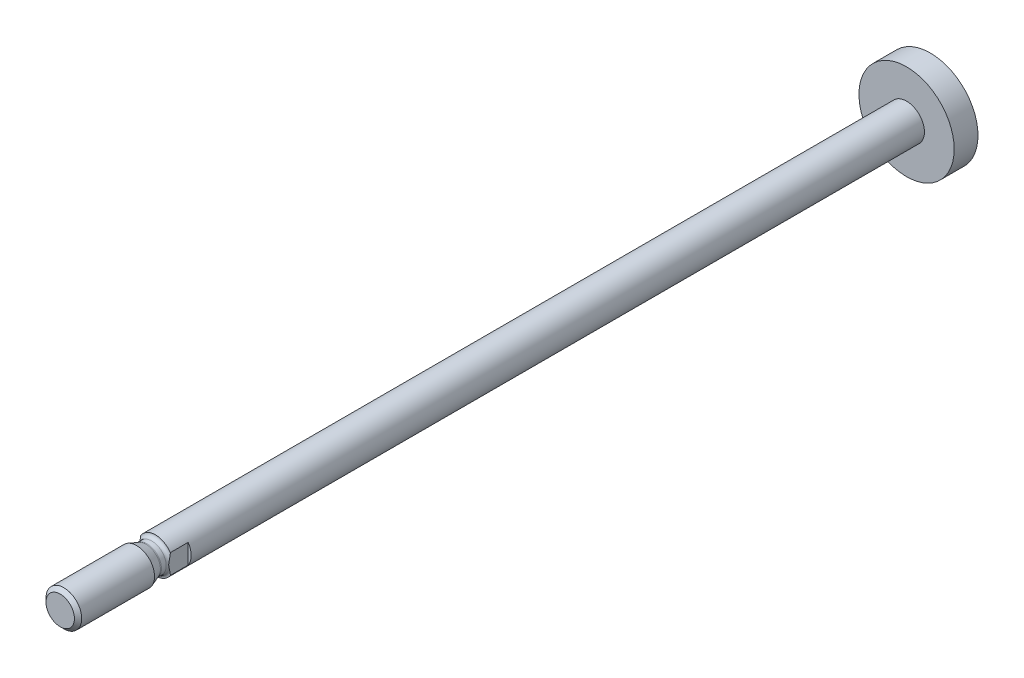
ISO-10303-21;
HEADER;
FILE_DESCRIPTION(('STEP AP214'),'2;1');
FILE_NAME('part.step','',(''),(''),'','','');
FILE_SCHEMA(('AUTOMOTIVE_DESIGN { 1 0 10303 214 1 1 1 1 }'));
ENDSEC;
DATA;
#1=APPLICATION_CONTEXT('core data for automotive mechanical design processes');
#2=APPLICATION_PROTOCOL_DEFINITION('international standard','automotive_design',2000,#1);
#3=PRODUCT_CONTEXT('',#1,'mechanical');
#4=PRODUCT('Part','Part','',(#3));
#5=PRODUCT_RELATED_PRODUCT_CATEGORY('part','',(#4));
#6=PRODUCT_DEFINITION_FORMATION('','',#4);
#7=PRODUCT_DEFINITION_CONTEXT('part definition',#1,'design');
#8=PRODUCT_DEFINITION('design','',#6,#7);
#9=PRODUCT_DEFINITION_SHAPE('','',#8);
#10=(LENGTH_UNIT() NAMED_UNIT(*) SI_UNIT(.MILLI.,.METRE.));
#11=(NAMED_UNIT(*) PLANE_ANGLE_UNIT() SI_UNIT($,.RADIAN.));
#12=(NAMED_UNIT(*) SI_UNIT($,.STERADIAN.) SOLID_ANGLE_UNIT());
#13=UNCERTAINTY_MEASURE_WITH_UNIT(LENGTH_MEASURE(1.E-05),#10,'distance_accuracy_value','');
#14=(GEOMETRIC_REPRESENTATION_CONTEXT(3) GLOBAL_UNCERTAINTY_ASSIGNED_CONTEXT((#13)) GLOBAL_UNIT_ASSIGNED_CONTEXT((#10,
#11,#12)) REPRESENTATION_CONTEXT('',''));
#15=CARTESIAN_POINT('',(0.,0.,0.));
#16=DIRECTION('',(0.,0.,1.));
#17=DIRECTION('',(1.,0.,0.));
#18=AXIS2_PLACEMENT_3D('',#15,#16,#17);
#19=CARTESIAN_POINT('',(0.,0.,-125.2));
#20=DIRECTION('',(0.,0.,1.));
#21=DIRECTION('',(1.,0.,0.));
#22=AXIS2_PLACEMENT_3D('',#19,#20,#21);
#23=CYLINDRICAL_SURFACE('',#22,3.);
#24=CARTESIAN_POINT('',(0.,0.,-121.2));
#25=DIRECTION('',(0.,0.,1.));
#26=DIRECTION('',(1.,0.,0.));
#27=AXIS2_PLACEMENT_3D('',#24,#25,#26);
#28=CIRCLE('',#27,3.);
#29=CARTESIAN_POINT('',(3.,0.,-121.2));
#30=VERTEX_POINT('',#29);
#31=EDGE_CURVE('E125',#30,#30,#28,.T.);
#32=ORIENTED_EDGE('',*,*,#31,.T.);
#33=EDGE_LOOP('',(#32));
#34=FACE_BOUND('',#33,.T.);
#35=DIRECTION('',(0.,0.,1.));
#36=VECTOR('',#35,1.);
#37=CARTESIAN_POINT('',(-2.5,-1.6583123951777,-125.2));
#38=LINE('',#37,#36);
#39=CARTESIAN_POINT('',(-2.5,-1.6583123951777,2.));
#40=VERTEX_POINT('',#39);
#41=CARTESIAN_POINT('',(-2.5,-1.6583123951777,5.));
#42=VERTEX_POINT('',#41);
#43=EDGE_CURVE('E55',#40,#42,#38,.T.);
#44=ORIENTED_EDGE('',*,*,#43,.F.);
#45=CARTESIAN_POINT('',(0.,0.,2.));
#46=DIRECTION('',(0.,0.,1.));
#47=DIRECTION('',(1.,0.,0.));
#48=AXIS2_PLACEMENT_3D('',#45,#46,#47);
#49=CIRCLE('',#48,3.);
#50=CARTESIAN_POINT('',(-2.5,1.6583123951777,2.));
#51=VERTEX_POINT('',#50);
#52=EDGE_CURVE('E11',#51,#40,#49,.T.);
#53=ORIENTED_EDGE('',*,*,#52,.F.);
#54=DIRECTION('',(0.,0.,1.));
#55=VECTOR('',#54,1.);
#56=CARTESIAN_POINT('',(-2.5,1.6583123951777,-125.2));
#57=LINE('',#56,#55);
#58=CARTESIAN_POINT('',(-2.5,1.65831239517778,4.99999999999909));
#59=VERTEX_POINT('',#58);
#60=EDGE_CURVE('E95',#59,#51,#57,.F.);
#61=ORIENTED_EDGE('',*,*,#60,.F.);
#62=CARTESIAN_POINT('',(0.,0.,5.));
#63=DIRECTION('',(0.,0.,1.));
#64=DIRECTION('',(1.,0.,0.));
#65=AXIS2_PLACEMENT_3D('',#62,#63,#64);
#66=CIRCLE('',#65,3.);
#67=CARTESIAN_POINT('',(2.5,1.6583123951777,5.));
#68=VERTEX_POINT('',#67);
#69=EDGE_CURVE('E94',#68,#59,#66,.T.);
#70=ORIENTED_EDGE('',*,*,#69,.F.);
#71=DIRECTION('',(0.,0.,1.));
#72=VECTOR('',#71,1.);
#73=CARTESIAN_POINT('',(2.5,1.6583123951777,-125.2));
#74=LINE('',#73,#72);
#75=CARTESIAN_POINT('',(2.5,1.6583123951777,2.));
#76=VERTEX_POINT('',#75);
#77=EDGE_CURVE('E63',#76,#68,#74,.T.);
#78=ORIENTED_EDGE('',*,*,#77,.F.);
#79=CARTESIAN_POINT('',(2.5,-1.6583123951777,2.));
#80=VERTEX_POINT('',#79);
#81=EDGE_CURVE('E44',#80,#76,#49,.T.);
#82=ORIENTED_EDGE('',*,*,#81,.F.);
#83=DIRECTION('',(0.,0.,1.));
#84=VECTOR('',#83,1.);
#85=CARTESIAN_POINT('',(2.5,-1.6583123951777,-125.2));
#86=LINE('',#85,#84);
#87=CARTESIAN_POINT('',(2.5,-1.65831239517778,4.99999999999909));
#88=VERTEX_POINT('',#87);
#89=EDGE_CURVE('E88',#88,#80,#86,.F.);
#90=ORIENTED_EDGE('',*,*,#89,.F.);
#91=EDGE_CURVE('E128',#42,#88,#66,.T.);
#92=ORIENTED_EDGE('',*,*,#91,.F.);
#93=EDGE_LOOP('',(#44,#53,#61,#70,#78,#82,#90,#92));
#94=FACE_BOUND('',#93,.T.);
#95=ADVANCED_FACE('F41',(#34,#94),#23,.T.);
#96=CARTESIAN_POINT('',(0.,0.,5.6000000000001));
#97=DIRECTION('',(0.,0.,1.));
#98=DIRECTION('',(1.,0.,0.));
#99=AXIS2_PLACEMENT_3D('',#96,#97,#98);
#100=TOROIDAL_SURFACE('',#99,3.0000000000001,0.600000000000099);
#101=CARTESIAN_POINT('',(0.,0.,5.6));
#102=DIRECTION('',(0.,0.,1.));
#103=DIRECTION('',(1.,0.,0.));
#104=AXIS2_PLACEMENT_3D('',#101,#102,#103);
#105=CIRCLE('',#104,2.4);
#106=CARTESIAN_POINT('',(2.4,0.,5.6));
#107=VERTEX_POINT('',#106);
#108=EDGE_CURVE('E116',#107,#107,#105,.T.);
#109=ORIENTED_EDGE('',*,*,#108,.F.);
#110=EDGE_LOOP('',(#109));
#111=FACE_BOUND('',#110,.T.);
#112=CARTESIAN_POINT('',(-2.5,0.,5.26833752096453));
#113=CARTESIAN_POINT('',(-2.5,0.0507234426297441,5.26834839993848));
#114=CARTESIAN_POINT('',(-2.5,0.101441776799662,5.26596843791489));
#115=CARTESIAN_POINT('',(-2.5,0.202536067556288,5.2569952015163));
#116=CARTESIAN_POINT('',(-2.5,0.252911588949165,5.2503973212644));
#117=CARTESIAN_POINT('',(-2.5,0.35392632203634,5.23403658213965));
#118=CARTESIAN_POINT('',(-2.5,0.404557369480025,5.224225913585));
#119=CARTESIAN_POINT('',(-2.5,0.505400398866161,5.20278595137819));
#120=CARTESIAN_POINT('',(-2.5,0.555612509775304,5.1911572409283));
#121=CARTESIAN_POINT('',(-2.5,0.655655613826413,5.16721678219831));
#122=CARTESIAN_POINT('',(-2.5,0.705487327239528,5.15490798008948));
#123=CARTESIAN_POINT('',(-2.5,0.805181864056362,5.13041893752706));
#124=CARTESIAN_POINT('',(-2.5,0.855044688832192,5.11823870324147));
#125=CARTESIAN_POINT('',(-2.5,1.00507376125951,5.08293674920261));
#126=CARTESIAN_POINT('',(-2.5,1.1055660279648,5.06108488117838));
#127=CARTESIAN_POINT('',(-2.5,1.30645493621981,5.02592717471424));
#128=CARTESIAN_POINT('',(-2.5,1.40682678389803,5.01248870030289));
#129=CARTESIAN_POINT('',(-2.5,1.60840199518987,4.99838763017595));
#130=CARTESIAN_POINT('',(-2.5,1.70960094347028,4.99767823287719));
#131=CARTESIAN_POINT('',(-2.5,1.86622781794818,5.01106448653587));
#132=CARTESIAN_POINT('',(-2.5,1.92218137883188,5.01877622049858));
#133=CARTESIAN_POINT('',(-2.5,2.03285053262341,5.0413651074687));
#134=CARTESIAN_POINT('',(-2.5,2.08756307823151,5.05625824117348));
#135=CARTESIAN_POINT('',(-2.5,2.18328084843635,5.09083457513036));
#136=CARTESIAN_POINT('',(-2.5,2.22483950461237,5.10896465354793));
#137=CARTESIAN_POINT('',(-2.5,2.30459524648064,5.1515245306446));
#138=CARTESIAN_POINT('',(-2.5,2.34279989724468,5.17593963670877));
#139=CARTESIAN_POINT('',(-2.5,2.40362753966407,5.22361594487622));
#140=CARTESIAN_POINT('',(-2.5,2.42757076392253,5.24518752529637));
#141=CARTESIAN_POINT('',(-2.5,2.47175757689057,5.29185573262645));
#142=CARTESIAN_POINT('',(-2.5,2.49200531158724,5.31694835263777));
#143=CARTESIAN_POINT('',(-2.5,2.52468492158815,5.36594738678137));
#144=CARTESIAN_POINT('',(-2.5,2.53785643218482,5.38935828111803));
#145=CARTESIAN_POINT('',(-2.5,2.56013164913301,5.43805384411947));
#146=CARTESIAN_POINT('',(-2.5,2.56923737677398,5.46333757440499));
#147=CARTESIAN_POINT('',(-2.5,2.58283057049981,5.51527496834575));
#148=CARTESIAN_POINT('',(-2.5,2.58729356105886,5.54193512227162));
#149=CARTESIAN_POINT('',(-2.5,2.59118020467599,5.59561989324821));
#150=CARTESIAN_POINT('',(-2.5,2.5906054179438,5.62264439487102));
#151=CARTESIAN_POINT('',(-2.5,2.5847447911938,5.67371298536964));
#152=CARTESIAN_POINT('',(-2.5,2.57988467167735,5.69780754958458));
#153=CARTESIAN_POINT('',(-2.5,2.56633022368149,5.74488485425705));
#154=CARTESIAN_POINT('',(-2.5,2.55763543991684,5.76786746233366));
#155=CARTESIAN_POINT('',(-2.5,2.53647695281551,5.81308697753744));
#156=CARTESIAN_POINT('',(-2.5,2.52388217742275,5.83526203314746));
#157=CARTESIAN_POINT('',(-2.5,2.49565831542702,5.87756858678122));
#158=CARTESIAN_POINT('',(-2.5,2.4800283022487,5.897699457906));
#159=CARTESIAN_POINT('',(-2.5,2.4381803160609,5.94494905141413));
#160=CARTESIAN_POINT('',(-2.5,2.41048793322772,5.97076525046522));
#161=CARTESIAN_POINT('',(-2.5,2.35128940318857,6.01762864695372));
#162=CARTESIAN_POINT('',(-2.5,2.31977194494069,6.03866114436212));
#163=CARTESIAN_POINT('',(-2.5,2.23952256294481,6.08463351159361));
#164=CARTESIAN_POINT('',(-2.5,2.18939204577726,6.10711912432076));
#165=CARTESIAN_POINT('',(-2.5,2.086424206848,6.14398267826286));
#166=CARTESIAN_POINT('',(-2.5,2.03358928965091,6.15836768991921));
#167=CARTESIAN_POINT('',(-2.5,1.93599580204544,6.17849484994285));
#168=CARTESIAN_POINT('',(-2.5,1.89144834077192,6.18531116329585));
#169=CARTESIAN_POINT('',(-2.5,1.80189908033616,6.19505697557448));
#170=CARTESIAN_POINT('',(-2.5,1.75689686177072,6.19798247787778));
#171=CARTESIAN_POINT('',(-2.5,1.66646832286127,6.20053377831371));
#172=CARTESIAN_POINT('',(-2.5,1.6210413945456,6.20013412759755));
#173=CARTESIAN_POINT('',(-2.5,1.53034280767568,6.19650595241103));
#174=CARTESIAN_POINT('',(-2.5,1.48507106445849,6.1932793543307));
#175=CARTESIAN_POINT('',(-2.5,1.33918047559004,6.17906735223514));
#176=CARTESIAN_POINT('',(-2.5,1.23902345631669,6.16342028964884));
#177=CARTESIAN_POINT('',(-2.5,1.03994836030368,6.12508984420092));
#178=CARTESIAN_POINT('',(-2.5,0.941034235224376,6.10238806221333));
#179=CARTESIAN_POINT('',(-2.5,0.793509038998567,6.06677672186832));
#180=CARTESIAN_POINT('',(-2.5,0.7446863854637,6.054702575567));
#181=CARTESIAN_POINT('',(-2.5,0.646996290398524,6.030738686552));
#182=CARTESIAN_POINT('',(-2.5,0.598128851070118,6.0188489352388));
#183=CARTESIAN_POINT('',(-2.5,0.500334281886721,5.99617397742217));
#184=CARTESIAN_POINT('',(-2.5,0.451408146263369,5.98538460255591));
#185=CARTESIAN_POINT('',(-2.5,0.353119090508098,5.96594052833405));
#186=CARTESIAN_POINT('',(-2.5,0.303756196305667,5.95728570312374));
#187=CARTESIAN_POINT('',(-2.5,0.204122497966492,5.94328110899502));
#188=CARTESIAN_POINT('',(-2.5,0.153847567097064,5.93795905985694));
#189=CARTESIAN_POINT('',(-2.5,0.0530351286873156,5.93177082830429));
#190=CARTESIAN_POINT('',(-2.5,0.0024977994589948,5.930901937583));
#191=CARTESIAN_POINT('',(-2.5,-0.0985305210715612,5.93381110626722));
#192=CARTESIAN_POINT('',(-2.5,-0.14902123482016,5.93759813511376));
#193=CARTESIAN_POINT('',(-2.5,-0.249573888409545,5.94904126176878));
#194=CARTESIAN_POINT('',(-2.5,-0.299635458091892,5.95670041313862));
#195=CARTESIAN_POINT('',(-2.5,-0.399725252919972,5.97472154484855));
#196=CARTESIAN_POINT('',(-2.5,-0.449748880216866,5.98510788708088));
#197=CARTESIAN_POINT('',(-2.5,-0.549453617514231,6.00732659888942));
#198=CARTESIAN_POINT('',(-2.5,-0.599134785603654,6.01915871651809));
#199=CARTESIAN_POINT('',(-2.5,-0.698392421521691,6.04328051823731));
#200=CARTESIAN_POINT('',(-2.5,-0.747968869022546,6.05557028383309));
#201=CARTESIAN_POINT('',(-2.5,-0.84720464589227,6.07981009984425));
#202=CARTESIAN_POINT('',(-2.5,-0.896863971124109,6.0917601667094));
#203=CARTESIAN_POINT('',(-2.5,-0.975241469303783,6.10978478042876));
#204=CARTESIAN_POINT('',(-2.5,-1.00388150216564,6.11619624816889));
#205=CARTESIAN_POINT('',(-2.5,-1.06125902675178,6.12857195456169));
#206=CARTESIAN_POINT('',(-2.5,-1.08999652018277,6.13453618533974));
#207=CARTESIAN_POINT('',(-2.5,-1.14748265723325,6.1458846074232));
#208=CARTESIAN_POINT('',(-2.5,-1.17623091126653,6.15127075206469));
#209=CARTESIAN_POINT('',(-2.5,-1.23384312688132,6.16137594760793));
#210=CARTESIAN_POINT('',(-2.5,-1.26270708577413,6.16609501391968));
#211=CARTESIAN_POINT('',(-2.5,-1.34949136584038,6.17908804539659));
#212=CARTESIAN_POINT('',(-2.5,-1.40759592627029,6.18619616796949));
#213=CARTESIAN_POINT('',(-2.5,-1.52420669712544,6.19636423685649));
#214=CARTESIAN_POINT('',(-2.5,-1.58271310503325,6.1994220245478));
#215=CARTESIAN_POINT('',(-2.5,-1.70911532678372,6.20051114496721));
#216=CARTESIAN_POINT('',(-2.5,-1.77702602049488,6.19766666103081));
#217=CARTESIAN_POINT('',(-2.5,-1.912149147007,6.18315262249392));
#218=CARTESIAN_POINT('',(-2.5,-1.97936016975703,6.17146782027944));
#219=CARTESIAN_POINT('',(-2.5,-2.09293467910467,6.14162835403314));
#220=CARTESIAN_POINT('',(-2.5,-2.1399801193776,6.12611102431254));
#221=CARTESIAN_POINT('',(-2.5,-2.23116163556241,6.08815370009842));
#222=CARTESIAN_POINT('',(-2.5,-2.27530548479003,6.06573319994486));
#223=CARTESIAN_POINT('',(-2.5,-2.34660579555824,6.0206656653127));
#224=CARTESIAN_POINT('',(-2.5,-2.37498330055351,5.99995880382842));
#225=CARTESIAN_POINT('',(-2.5,-2.42818185419372,5.95435228802646));
#226=CARTESIAN_POINT('',(-2.5,-2.45300628498281,5.92945667074117));
#227=CARTESIAN_POINT('',(-2.5,-2.49337206402375,5.88080957286876));
#228=CARTESIAN_POINT('',(-2.5,-2.50977972671913,5.85778028891266));
#229=CARTESIAN_POINT('',(-2.5,-2.5385948801776,5.80932543735906));
#230=CARTESIAN_POINT('',(-2.5,-2.55100468980703,5.7839012699618));
#231=CARTESIAN_POINT('',(-2.5,-2.57111606880391,5.7310152189761));
#232=CARTESIAN_POINT('',(-2.5,-2.57878240755407,5.70353974708557));
#233=CARTESIAN_POINT('',(-2.5,-2.58865812747843,5.64762323062993));
#234=CARTESIAN_POINT('',(-2.5,-2.59087093912576,5.61918280447873));
#235=CARTESIAN_POINT('',(-2.5,-2.58974032110845,5.56589468768046));
#236=CARTESIAN_POINT('',(-2.5,-2.58704036062141,5.54103102121321));
#237=CARTESIAN_POINT('',(-2.5,-2.57748265423562,5.49212434637714));
#238=CARTESIAN_POINT('',(-2.5,-2.57062518368025,5.46808128377277));
#239=CARTESIAN_POINT('',(-2.5,-2.55318309970271,5.42147694109437));
#240=CARTESIAN_POINT('',(-2.5,-2.54260847384664,5.39891188066154));
#241=CARTESIAN_POINT('',(-2.5,-2.51826231502416,5.35558968714916));
#242=CARTESIAN_POINT('',(-2.5,-2.50448933519591,5.33483337816906));
#243=CARTESIAN_POINT('',(-2.5,-2.46797257111134,5.28708275256527));
#244=CARTESIAN_POINT('',(-2.5,-2.44388663659998,5.26111270404154));
#245=CARTESIAN_POINT('',(-2.5,-2.39183121173732,5.21341702762138));
#246=CARTESIAN_POINT('',(-2.5,-2.36385414462067,5.19169988455002));
#247=CARTESIAN_POINT('',(-2.5,-2.29309604385226,5.14424955817408));
#248=CARTESIAN_POINT('',(-2.5,-2.24896151787955,5.12054273771195));
#249=CARTESIAN_POINT('',(-2.5,-2.15755724893995,5.08032986787273));
#250=CARTESIAN_POINT('',(-2.5,-2.1102815253453,5.0638380357592));
#251=CARTESIAN_POINT('',(-2.5,-1.98539576167196,5.02901994971649));
#252=CARTESIAN_POINT('',(-2.5,-1.90647682078743,5.01544295171964));
#253=CARTESIAN_POINT('',(-2.5,-1.74768813149434,5.00017484346382));
#254=CARTESIAN_POINT('',(-2.5,-1.66781762927049,4.99849388464395));
#255=CARTESIAN_POINT('',(-2.5,-1.45429321635247,5.00579419289827));
#256=CARTESIAN_POINT('',(-2.5,-1.32097329964418,5.02279704607492));
#257=CARTESIAN_POINT('',(-2.5,-1.12273292987174,5.05843900515103));
#258=CARTESIAN_POINT('',(-2.5,-1.05669317759064,5.07208123732001));
#259=CARTESIAN_POINT('',(-2.5,-0.925080173294097,5.10144856377507));
#260=CARTESIAN_POINT('',(-2.5,-0.85950678696237,5.11717303045709));
#261=CARTESIAN_POINT('',(-2.5,-0.728157455724953,5.14928145287764));
#262=CARTESIAN_POINT('',(-2.5,-0.662382356378558,5.16566853749943));
#263=CARTESIAN_POINT('',(-2.5,-0.530451230737349,5.19710748690057));
#264=CARTESIAN_POINT('',(-2.5,-0.46429498692756,5.21215848739435));
#265=CARTESIAN_POINT('',(-2.5,-0.332137198799993,5.23811298682939));
#266=CARTESIAN_POINT('',(-2.5,-0.266147995614798,5.24907485812429));
#267=CARTESIAN_POINT('',(-2.5,-0.13343508853748,5.26417313941374));
#268=CARTESIAN_POINT('',(-2.5,-0.0667131258677896,5.26832321258322));
#269=CARTESIAN_POINT('',(-2.5,0.,5.26833752096453));
#270=B_SPLINE_CURVE_WITH_KNOTS('',3,(#112,#113,#114,#115,#116,#117,#118,#119,#120,#121,#122,
#123,#124,#125,#126,#127,#128,#129,#130,#131,#132,#133,#134,#135,#136,#137,#138,#139,#140,#141,
#142,#143,#144,#145,#146,#147,#148,#149,#150,#151,#152,#153,#154,#155,#156,#157,#158,#159,#160,
#161,#162,#163,#164,#165,#166,#167,#168,#169,#170,#171,#172,#173,#174,#175,#176,#177,#178,#179,
#180,#181,#182,#183,#184,#185,#186,#187,#188,#189,#190,#191,#192,#193,#194,#195,#196,#197,#198,
#199,#200,#201,#202,#203,#204,#205,#206,#207,#208,#209,#210,#211,#212,#213,#214,#215,#216,#217,
#218,#219,#220,#221,#222,#223,#224,#225,#226,#227,#228,#229,#230,#231,#232,#233,#234,#235,#236,
#237,#238,#239,#240,#241,#242,#243,#244,#245,#246,#247,#248,#249,#250,#251,#252,#253,#254,#255,
#256,#257,#258,#259,#260,#261,#262,#263,#264,#265,#266,#267,#268,#269),.UNSPECIFIED.,.T.,.F.,(4,
2,2,2,2,2,2,2,2,2,2,2,2,2,2,2,2,2,2,2,2,2,2,2,2,2,2,2,2,2,2,2,2,2,2,2,2,2,2,2,2,2,2,2,2,2,2,2,2,
2,2,2,2,2,2,2,2,2,2,2,2,2,2,2,2,2,2,2,2,2,2,2,2,2,2,2,2,2,4),(0.,0.152115749462961,
0.304397890479205,0.459057777660119,0.613668153537359,0.76765452052503,0.921648241698668,
1.22999186740174,1.53334327295527,1.83557910296654,2.00468122496769,2.17416139710525,
2.30975526259906,2.44503498191611,2.54138706790922,2.63763038250484,2.71788414225495,
2.79809795959123,2.87873253660465,2.95934214181033,3.03274594433316,3.10615846435156,
3.18237030946167,3.25860545664829,3.37154774885102,3.48483255287211,3.64874326809032,
3.81251069461259,3.94751849926572,4.08266487644991,4.21884653384819,4.35493546397263,
4.65852821936571,4.96291950372185,5.11380283698696,5.2646791123006,5.41496078164642,
5.56523358814694,5.71674021710462,5.86815469233289,6.01986131905259,6.17168776888823,
6.3249195654772,6.47812469716163,6.63135724578266,6.7845823615018,6.87262624262423,
6.9606716735928,7.04840955727845,7.13614541382411,7.31164210225534,7.487232283928,
7.69072100095721,7.89456149389004,8.04275027379228,8.1905243529531,8.29556794817655,
8.40051087855684,8.48500651711341,8.56945305722983,8.65451949621374,8.73953241154295,
8.81419843639983,8.88885951681877,8.96332150589878,9.03781724571823,9.14348655987521,
9.24936459025057,9.39882327642183,9.54857516145059,9.78744806917548,10.0265247936209,
10.4280628477144,10.630387719692,10.8326517473681,11.0360188284461,11.239516519211,
11.439986712254,11.6400543065313),.UNSPECIFIED.);
#271=EDGE_CURVE('E86',#42,#59,#270,.T.);
#272=ORIENTED_EDGE('',*,*,#271,.F.);
#273=ORIENTED_EDGE('',*,*,#91,.T.);
#274=CARTESIAN_POINT('',(2.5,0.,5.26833752096453));
#275=CARTESIAN_POINT('',(2.5,-0.0507234426297441,5.26834839993848));
#276=CARTESIAN_POINT('',(2.5,-0.101441776799662,5.26596843791489));
#277=CARTESIAN_POINT('',(2.5,-0.202536067556288,5.2569952015163));
#278=CARTESIAN_POINT('',(2.5,-0.252911588949165,5.2503973212644));
#279=CARTESIAN_POINT('',(2.5,-0.35392632203634,5.23403658213965));
#280=CARTESIAN_POINT('',(2.5,-0.404557369480025,5.224225913585));
#281=CARTESIAN_POINT('',(2.5,-0.505400398866161,5.20278595137819));
#282=CARTESIAN_POINT('',(2.5,-0.555612509775304,5.1911572409283));
#283=CARTESIAN_POINT('',(2.5,-0.655655613826413,5.16721678219831));
#284=CARTESIAN_POINT('',(2.5,-0.705487327239528,5.15490798008948));
#285=CARTESIAN_POINT('',(2.5,-0.805181864056362,5.13041893752706));
#286=CARTESIAN_POINT('',(2.5,-0.855044688832192,5.11823870324147));
#287=CARTESIAN_POINT('',(2.5,-1.00507376125951,5.08293674920261));
#288=CARTESIAN_POINT('',(2.5,-1.1055660279648,5.06108488117838));
#289=CARTESIAN_POINT('',(2.5,-1.30645493621981,5.02592717471424));
#290=CARTESIAN_POINT('',(2.5,-1.40682678389803,5.01248870030289));
#291=CARTESIAN_POINT('',(2.5,-1.60840199518987,4.99838763017595));
#292=CARTESIAN_POINT('',(2.5,-1.70960094347028,4.99767823287719));
#293=CARTESIAN_POINT('',(2.5,-1.86622781794818,5.01106448653587));
#294=CARTESIAN_POINT('',(2.5,-1.92218137883188,5.01877622049858));
#295=CARTESIAN_POINT('',(2.5,-2.03285053262341,5.0413651074687));
#296=CARTESIAN_POINT('',(2.5,-2.08756307823151,5.05625824117348));
#297=CARTESIAN_POINT('',(2.5,-2.18328084843635,5.09083457513036));
#298=CARTESIAN_POINT('',(2.5,-2.22483950461237,5.10896465354793));
#299=CARTESIAN_POINT('',(2.5,-2.30459524648064,5.1515245306446));
#300=CARTESIAN_POINT('',(2.5,-2.34279989724468,5.17593963670877));
#301=CARTESIAN_POINT('',(2.5,-2.40362753966407,5.22361594487622));
#302=CARTESIAN_POINT('',(2.5,-2.42757076392253,5.24518752529637));
#303=CARTESIAN_POINT('',(2.5,-2.47175757689057,5.29185573262645));
#304=CARTESIAN_POINT('',(2.5,-2.49200531158724,5.31694835263777));
#305=CARTESIAN_POINT('',(2.5,-2.52468492158815,5.36594738678137));
#306=CARTESIAN_POINT('',(2.5,-2.53785643218482,5.38935828111803));
#307=CARTESIAN_POINT('',(2.5,-2.56013164913301,5.43805384411947));
#308=CARTESIAN_POINT('',(2.5,-2.56923737677398,5.46333757440499));
#309=CARTESIAN_POINT('',(2.5,-2.58283057049981,5.51527496834575));
#310=CARTESIAN_POINT('',(2.5,-2.58729356105886,5.54193512227162));
#311=CARTESIAN_POINT('',(2.5,-2.59118020467599,5.59561989324821));
#312=CARTESIAN_POINT('',(2.5,-2.5906054179438,5.62264439487102));
#313=CARTESIAN_POINT('',(2.5,-2.5847447911938,5.67371298536964));
#314=CARTESIAN_POINT('',(2.5,-2.57988467167735,5.69780754958458));
#315=CARTESIAN_POINT('',(2.5,-2.56633022368149,5.74488485425705));
#316=CARTESIAN_POINT('',(2.5,-2.55763543991684,5.76786746233366));
#317=CARTESIAN_POINT('',(2.5,-2.53647695281551,5.81308697753744));
#318=CARTESIAN_POINT('',(2.5,-2.52388217742275,5.83526203314746));
#319=CARTESIAN_POINT('',(2.5,-2.49565831542702,5.87756858678122));
#320=CARTESIAN_POINT('',(2.5,-2.4800283022487,5.897699457906));
#321=CARTESIAN_POINT('',(2.5,-2.4381803160609,5.94494905141413));
#322=CARTESIAN_POINT('',(2.5,-2.41048793322772,5.97076525046522));
#323=CARTESIAN_POINT('',(2.5,-2.35128940318857,6.01762864695372));
#324=CARTESIAN_POINT('',(2.5,-2.31977194494069,6.03866114436212));
#325=CARTESIAN_POINT('',(2.5,-2.23952256294481,6.08463351159361));
#326=CARTESIAN_POINT('',(2.5,-2.18939204577726,6.10711912432076));
#327=CARTESIAN_POINT('',(2.5,-2.086424206848,6.14398267826286));
#328=CARTESIAN_POINT('',(2.5,-2.03358928965091,6.15836768991921));
#329=CARTESIAN_POINT('',(2.5,-1.93599580204544,6.17849484994285));
#330=CARTESIAN_POINT('',(2.5,-1.89144834077192,6.18531116329585));
#331=CARTESIAN_POINT('',(2.5,-1.80189908033616,6.19505697557448));
#332=CARTESIAN_POINT('',(2.5,-1.75689686177072,6.19798247787778));
#333=CARTESIAN_POINT('',(2.5,-1.66646832286127,6.20053377831371));
#334=CARTESIAN_POINT('',(2.5,-1.6210413945456,6.20013412759755));
#335=CARTESIAN_POINT('',(2.5,-1.53034280767568,6.19650595241103));
#336=CARTESIAN_POINT('',(2.5,-1.48507106445849,6.1932793543307));
#337=CARTESIAN_POINT('',(2.5,-1.33918047559004,6.17906735223514));
#338=CARTESIAN_POINT('',(2.5,-1.23902345631669,6.16342028964884));
#339=CARTESIAN_POINT('',(2.5,-1.03994836030368,6.12508984420092));
#340=CARTESIAN_POINT('',(2.5,-0.941034235224376,6.10238806221333));
#341=CARTESIAN_POINT('',(2.5,-0.793509038998567,6.06677672186832));
#342=CARTESIAN_POINT('',(2.5,-0.7446863854637,6.054702575567));
#343=CARTESIAN_POINT('',(2.5,-0.646996290398524,6.030738686552));
#344=CARTESIAN_POINT('',(2.5,-0.598128851070118,6.0188489352388));
#345=CARTESIAN_POINT('',(2.5,-0.500334281886721,5.99617397742217));
#346=CARTESIAN_POINT('',(2.5,-0.451408146263369,5.98538460255591));
#347=CARTESIAN_POINT('',(2.5,-0.353119090508098,5.96594052833405));
#348=CARTESIAN_POINT('',(2.5,-0.303756196305667,5.95728570312374));
#349=CARTESIAN_POINT('',(2.5,-0.204122497966492,5.94328110899502));
#350=CARTESIAN_POINT('',(2.5,-0.153847567097064,5.93795905985694));
#351=CARTESIAN_POINT('',(2.5,-0.0530351286873156,5.93177082830429));
#352=CARTESIAN_POINT('',(2.5,-0.0024977994589948,5.930901937583));
#353=CARTESIAN_POINT('',(2.5,0.0985305210715612,5.93381110626722));
#354=CARTESIAN_POINT('',(2.5,0.14902123482016,5.93759813511376));
#355=CARTESIAN_POINT('',(2.5,0.249573888409545,5.94904126176878));
#356=CARTESIAN_POINT('',(2.5,0.299635458091892,5.95670041313862));
#357=CARTESIAN_POINT('',(2.5,0.399725252919972,5.97472154484855));
#358=CARTESIAN_POINT('',(2.5,0.449748880216866,5.98510788708088));
#359=CARTESIAN_POINT('',(2.5,0.549453617514231,6.00732659888942));
#360=CARTESIAN_POINT('',(2.5,0.599134785603654,6.01915871651809));
#361=CARTESIAN_POINT('',(2.5,0.698392421521691,6.04328051823731));
#362=CARTESIAN_POINT('',(2.5,0.747968869022546,6.05557028383309));
#363=CARTESIAN_POINT('',(2.5,0.84720464589227,6.07981009984425));
#364=CARTESIAN_POINT('',(2.5,0.896863971124109,6.0917601667094));
#365=CARTESIAN_POINT('',(2.5,0.975241469303783,6.10978478042876));
#366=CARTESIAN_POINT('',(2.5,1.00388150216564,6.11619624816889));
#367=CARTESIAN_POINT('',(2.5,1.06125902675178,6.12857195456169));
#368=CARTESIAN_POINT('',(2.5,1.08999652018277,6.13453618533974));
#369=CARTESIAN_POINT('',(2.5,1.14748265723325,6.1458846074232));
#370=CARTESIAN_POINT('',(2.5,1.17623091126653,6.15127075206469));
#371=CARTESIAN_POINT('',(2.5,1.23384312688132,6.16137594760793));
#372=CARTESIAN_POINT('',(2.5,1.26270708577413,6.16609501391968));
#373=CARTESIAN_POINT('',(2.5,1.34949136584038,6.17908804539659));
#374=CARTESIAN_POINT('',(2.5,1.40759592627029,6.18619616796949));
#375=CARTESIAN_POINT('',(2.5,1.52420669712544,6.19636423685649));
#376=CARTESIAN_POINT('',(2.5,1.58271310503325,6.1994220245478));
#377=CARTESIAN_POINT('',(2.5,1.70911532678372,6.20051114496721));
#378=CARTESIAN_POINT('',(2.5,1.77702602049488,6.19766666103081));
#379=CARTESIAN_POINT('',(2.5,1.912149147007,6.18315262249392));
#380=CARTESIAN_POINT('',(2.5,1.97936016975703,6.17146782027944));
#381=CARTESIAN_POINT('',(2.5,2.09293467910467,6.14162835403314));
#382=CARTESIAN_POINT('',(2.5,2.1399801193776,6.12611102431254));
#383=CARTESIAN_POINT('',(2.5,2.23116163556241,6.08815370009842));
#384=CARTESIAN_POINT('',(2.5,2.27530548479003,6.06573319994486));
#385=CARTESIAN_POINT('',(2.5,2.34660579555824,6.0206656653127));
#386=CARTESIAN_POINT('',(2.5,2.37498330055351,5.99995880382842));
#387=CARTESIAN_POINT('',(2.5,2.42818185419372,5.95435228802646));
#388=CARTESIAN_POINT('',(2.5,2.45300628498281,5.92945667074117));
#389=CARTESIAN_POINT('',(2.5,2.49337206402375,5.88080957286876));
#390=CARTESIAN_POINT('',(2.5,2.50977972671913,5.85778028891266));
#391=CARTESIAN_POINT('',(2.5,2.5385948801776,5.80932543735906));
#392=CARTESIAN_POINT('',(2.5,2.55100468980703,5.7839012699618));
#393=CARTESIAN_POINT('',(2.5,2.57111606880391,5.7310152189761));
#394=CARTESIAN_POINT('',(2.5,2.57878240755407,5.70353974708557));
#395=CARTESIAN_POINT('',(2.5,2.58865812747843,5.64762323062993));
#396=CARTESIAN_POINT('',(2.5,2.59087093912576,5.61918280447873));
#397=CARTESIAN_POINT('',(2.5,2.58974032110845,5.56589468768046));
#398=CARTESIAN_POINT('',(2.5,2.58704036062141,5.54103102121321));
#399=CARTESIAN_POINT('',(2.5,2.57748265423562,5.49212434637714));
#400=CARTESIAN_POINT('',(2.5,2.57062518368025,5.46808128377277));
#401=CARTESIAN_POINT('',(2.5,2.55318309970271,5.42147694109437));
#402=CARTESIAN_POINT('',(2.5,2.54260847384664,5.39891188066154));
#403=CARTESIAN_POINT('',(2.5,2.51826231502416,5.35558968714916));
#404=CARTESIAN_POINT('',(2.5,2.50448933519591,5.33483337816906));
#405=CARTESIAN_POINT('',(2.5,2.46797257111134,5.28708275256527));
#406=CARTESIAN_POINT('',(2.5,2.44388663659998,5.26111270404154));
#407=CARTESIAN_POINT('',(2.5,2.39183121173732,5.21341702762138));
#408=CARTESIAN_POINT('',(2.5,2.36385414462067,5.19169988455002));
#409=CARTESIAN_POINT('',(2.5,2.29309604385226,5.14424955817408));
#410=CARTESIAN_POINT('',(2.5,2.24896151787955,5.12054273771195));
#411=CARTESIAN_POINT('',(2.5,2.15755724893995,5.08032986787273));
#412=CARTESIAN_POINT('',(2.5,2.1102815253453,5.0638380357592));
#413=CARTESIAN_POINT('',(2.5,1.98539576167196,5.02901994971649));
#414=CARTESIAN_POINT('',(2.5,1.90647682078743,5.01544295171964));
#415=CARTESIAN_POINT('',(2.5,1.74768813149434,5.00017484346382));
#416=CARTESIAN_POINT('',(2.5,1.66781762927049,4.99849388464395));
#417=CARTESIAN_POINT('',(2.5,1.45429321635247,5.00579419289827));
#418=CARTESIAN_POINT('',(2.5,1.32097329964418,5.02279704607492));
#419=CARTESIAN_POINT('',(2.5,1.12273292987174,5.05843900515103));
#420=CARTESIAN_POINT('',(2.5,1.05669317759064,5.07208123732001));
#421=CARTESIAN_POINT('',(2.5,0.925080173294097,5.10144856377507));
#422=CARTESIAN_POINT('',(2.5,0.85950678696237,5.11717303045709));
#423=CARTESIAN_POINT('',(2.5,0.728157455724953,5.14928145287764));
#424=CARTESIAN_POINT('',(2.5,0.662382356378558,5.16566853749943));
#425=CARTESIAN_POINT('',(2.5,0.530451230737349,5.19710748690057));
#426=CARTESIAN_POINT('',(2.5,0.46429498692756,5.21215848739435));
#427=CARTESIAN_POINT('',(2.5,0.332137198799993,5.23811298682939));
#428=CARTESIAN_POINT('',(2.5,0.266147995614798,5.24907485812429));
#429=CARTESIAN_POINT('',(2.5,0.13343508853748,5.26417313941374));
#430=CARTESIAN_POINT('',(2.5,0.0667131258677896,5.26832321258322));
#431=CARTESIAN_POINT('',(2.5,0.,5.26833752096453));
#432=B_SPLINE_CURVE_WITH_KNOTS('',3,(#274,#275,#276,#277,#278,#279,#280,#281,#282,#283,#284,
#285,#286,#287,#288,#289,#290,#291,#292,#293,#294,#295,#296,#297,#298,#299,#300,#301,#302,#303,
#304,#305,#306,#307,#308,#309,#310,#311,#312,#313,#314,#315,#316,#317,#318,#319,#320,#321,#322,
#323,#324,#325,#326,#327,#328,#329,#330,#331,#332,#333,#334,#335,#336,#337,#338,#339,#340,#341,
#342,#343,#344,#345,#346,#347,#348,#349,#350,#351,#352,#353,#354,#355,#356,#357,#358,#359,#360,
#361,#362,#363,#364,#365,#366,#367,#368,#369,#370,#371,#372,#373,#374,#375,#376,#377,#378,#379,
#380,#381,#382,#383,#384,#385,#386,#387,#388,#389,#390,#391,#392,#393,#394,#395,#396,#397,#398,
#399,#400,#401,#402,#403,#404,#405,#406,#407,#408,#409,#410,#411,#412,#413,#414,#415,#416,#417,
#418,#419,#420,#421,#422,#423,#424,#425,#426,#427,#428,#429,#430,#431),.UNSPECIFIED.,.T.,.F.,(4,
2,2,2,2,2,2,2,2,2,2,2,2,2,2,2,2,2,2,2,2,2,2,2,2,2,2,2,2,2,2,2,2,2,2,2,2,2,2,2,2,2,2,2,2,2,2,2,2,
2,2,2,2,2,2,2,2,2,2,2,2,2,2,2,2,2,2,2,2,2,2,2,2,2,2,2,2,2,4),(0.,0.152115749462961,
0.304397890479205,0.459057777660119,0.613668153537359,0.76765452052503,0.921648241698668,
1.22999186740174,1.53334327295527,1.83557910296654,2.00468122496769,2.17416139710525,
2.30975526259906,2.44503498191611,2.54138706790922,2.63763038250484,2.71788414225495,
2.79809795959123,2.87873253660465,2.95934214181033,3.03274594433316,3.10615846435156,
3.18237030946167,3.25860545664829,3.37154774885102,3.48483255287211,3.64874326809032,
3.81251069461259,3.94751849926572,4.08266487644991,4.21884653384819,4.35493546397263,
4.65852821936571,4.96291950372185,5.11380283698696,5.2646791123006,5.41496078164642,
5.56523358814694,5.71674021710462,5.86815469233289,6.01986131905259,6.17168776888823,
6.3249195654772,6.47812469716163,6.63135724578266,6.7845823615018,6.87262624262423,
6.9606716735928,7.04840955727845,7.13614541382411,7.31164210225534,7.487232283928,
7.69072100095721,7.89456149389004,8.04275027379228,8.1905243529531,8.29556794817655,
8.40051087855684,8.48500651711341,8.56945305722983,8.65451949621374,8.73953241154295,
8.81419843639983,8.88885951681877,8.96332150589878,9.03781724571823,9.14348655987521,
9.24936459025057,9.39882327642183,9.54857516145059,9.78744806917548,10.0265247936209,
10.4280628477144,10.630387719692,10.8326517473681,11.0360188284461,11.239516519211,
11.439986712254,11.6400543065313),.UNSPECIFIED.);
#433=EDGE_CURVE('E130',#68,#88,#432,.T.);
#434=ORIENTED_EDGE('',*,*,#433,.F.);
#435=ORIENTED_EDGE('',*,*,#69,.T.);
#436=EDGE_LOOP('',(#272,#273,#434,#435));
#437=FACE_BOUND('',#436,.T.);
#438=ADVANCED_FACE('F140',(#111,#437),#100,.F.);
#439=CARTESIAN_POINT('',(0.,3.,-121.2));
#440=DIRECTION('',(0.,0.,-1.));
#441=DIRECTION('',(-1.,0.,0.));
#442=AXIS2_PLACEMENT_3D('',#439,#440,#441);
#443=PLANE('',#442);
#444=ORIENTED_EDGE('',*,*,#31,.F.);
#445=EDGE_LOOP('',(#444));
#446=FACE_BOUND('',#445,.T.);
#447=CARTESIAN_POINT('',(0.,0.,-121.2));
#448=DIRECTION('',(0.,0.,1.));
#449=DIRECTION('',(1.,0.,0.));
#450=AXIS2_PLACEMENT_3D('',#447,#448,#449);
#451=CIRCLE('',#450,8.);
#452=CARTESIAN_POINT('',(8.,0.,-121.2));
#453=VERTEX_POINT('',#452);
#454=EDGE_CURVE('E122',#453,#453,#451,.T.);
#455=ORIENTED_EDGE('',*,*,#454,.T.);
#456=EDGE_LOOP('',(#455));
#457=FACE_BOUND('',#456,.T.);
#458=ADVANCED_FACE('F188',(#446,#457),#443,.F.);
#459=CARTESIAN_POINT('',(0.,0.,-125.2));
#460=DIRECTION('',(0.,0.,1.));
#461=DIRECTION('',(1.,0.,0.));
#462=AXIS2_PLACEMENT_3D('',#459,#460,#461);
#463=CYLINDRICAL_SURFACE('',#462,8.);
#464=ORIENTED_EDGE('',*,*,#454,.F.);
#465=EDGE_LOOP('',(#464));
#466=FACE_BOUND('',#465,.T.);
#467=CARTESIAN_POINT('',(0.,0.,-125.2));
#468=DIRECTION('',(0.,0.,1.));
#469=DIRECTION('',(1.,0.,0.));
#470=AXIS2_PLACEMENT_3D('',#467,#468,#469);
#471=CIRCLE('',#470,8.);
#472=CARTESIAN_POINT('',(8.,0.,-125.2));
#473=VERTEX_POINT('',#472);
#474=EDGE_CURVE('E119',#473,#473,#471,.T.);
#475=ORIENTED_EDGE('',*,*,#474,.T.);
#476=EDGE_LOOP('',(#475));
#477=FACE_BOUND('',#476,.T.);
#478=ADVANCED_FACE('F179',(#466,#477),#463,.T.);
#479=CARTESIAN_POINT('',(0.,8.,-125.2));
#480=DIRECTION('',(0.,0.,1.));
#481=DIRECTION('',(1.,0.,0.));
#482=AXIS2_PLACEMENT_3D('',#479,#480,#481);
#483=PLANE('',#482);
#484=ORIENTED_EDGE('',*,*,#474,.F.);
#485=EDGE_LOOP('',(#484));
#486=FACE_BOUND('',#485,.T.);
#487=ADVANCED_FACE('F173',(#486),#483,.F.);
#488=CARTESIAN_POINT('',(0.,0.,4.));
#489=DIRECTION('',(0.,0.,1.));
#490=DIRECTION('',(1.,0.,0.));
#491=AXIS2_PLACEMENT_3D('',#488,#489,#490);
#492=CYLINDRICAL_SURFACE('',#491,2.4);
#493=CARTESIAN_POINT('',(0.,0.,6.3942038115749));
#494=DIRECTION('',(0.,0.,1.));
#495=DIRECTION('',(1.,0.,0.));
#496=AXIS2_PLACEMENT_3D('',#493,#494,#495);
#497=CIRCLE('',#496,2.4);
#498=CARTESIAN_POINT('',(2.4,0.,6.3942038115749));
#499=VERTEX_POINT('',#498);
#500=EDGE_CURVE('E113',#499,#499,#497,.T.);
#501=ORIENTED_EDGE('',*,*,#500,.F.);
#502=EDGE_LOOP('',(#501));
#503=FACE_BOUND('',#502,.T.);
#504=ORIENTED_EDGE('',*,*,#108,.T.);
#505=EDGE_LOOP('',(#504));
#506=FACE_BOUND('',#505,.T.);
#507=ADVANCED_FACE('F170',(#503,#506),#492,.T.);
#508=CARTESIAN_POINT('',(0.,0.,6.39420381157482));
#509=DIRECTION('',(0.,0.,1.));
#510=DIRECTION('',(1.,0.,0.));
#511=AXIS2_PLACEMENT_3D('',#508,#509,#510);
#512=TOROIDAL_SURFACE('',#511,2.99999999999972,0.599999999999719);
#513=CARTESIAN_POINT('',(0.,0.,6.5994158975703));
#514=DIRECTION('',(0.,0.,1.));
#515=DIRECTION('',(1.,0.,0.));
#516=AXIS2_PLACEMENT_3D('',#513,#514,#515);
#517=CIRCLE('',#516,2.4361844275285);
#518=CARTESIAN_POINT('',(2.4361844275285,0.,6.5994158975703));
#519=VERTEX_POINT('',#518);
#520=EDGE_CURVE('E110',#519,#519,#517,.T.);
#521=ORIENTED_EDGE('',*,*,#520,.F.);
#522=EDGE_LOOP('',(#521));
#523=FACE_BOUND('',#522,.T.);
#524=ORIENTED_EDGE('',*,*,#500,.T.);
#525=EDGE_LOOP('',(#524));
#526=FACE_BOUND('',#525,.T.);
#527=ADVANCED_FACE('F167',(#523,#526),#512,.F.);
#528=CARTESIAN_POINT('',(0.,0.,6.5994158975703));
#529=DIRECTION('',(0.,0.,1.));
#530=DIRECTION('',(1.,0.,0.));
#531=AXIS2_PLACEMENT_3D('',#528,#529,#530);
#532=CONICAL_SURFACE('',#531,2.4361844275285,0.34906585039883);
#533=CARTESIAN_POINT('',(0.,0.,8.1484864516728));
#534=DIRECTION('',(0.,0.,1.));
#535=DIRECTION('',(1.,0.,0.));
#536=AXIS2_PLACEMENT_3D('',#533,#534,#535);
#537=CIRCLE('',#536,3.);
#538=CARTESIAN_POINT('',(3.,0.,8.1484864516728));
#539=VERTEX_POINT('',#538);
#540=EDGE_CURVE('E107',#539,#539,#537,.T.);
#541=ORIENTED_EDGE('',*,*,#540,.F.);
#542=EDGE_LOOP('',(#541));
#543=FACE_BOUND('',#542,.T.);
#544=ORIENTED_EDGE('',*,*,#520,.T.);
#545=EDGE_LOOP('',(#544));
#546=FACE_BOUND('',#545,.T.);
#547=ADVANCED_FACE('F163',(#543,#546),#532,.T.);
#548=CARTESIAN_POINT('',(0.,0.,4.));
#549=DIRECTION('',(0.,0.,1.));
#550=DIRECTION('',(1.,0.,0.));
#551=AXIS2_PLACEMENT_3D('',#548,#549,#550);
#552=CYLINDRICAL_SURFACE('',#551,3.);
#553=CARTESIAN_POINT('',(0.,0.,20.3865));
#554=DIRECTION('',(0.,0.,1.));
#555=DIRECTION('',(1.,0.,0.));
#556=AXIS2_PLACEMENT_3D('',#553,#554,#555);
#557=CIRCLE('',#556,3.);
#558=CARTESIAN_POINT('',(3.,0.,20.3865));
#559=VERTEX_POINT('',#558);
#560=EDGE_CURVE('E104',#559,#559,#557,.T.);
#561=ORIENTED_EDGE('',*,*,#560,.F.);
#562=EDGE_LOOP('',(#561));
#563=FACE_BOUND('',#562,.T.);
#564=ORIENTED_EDGE('',*,*,#540,.T.);
#565=EDGE_LOOP('',(#564));
#566=FACE_BOUND('',#565,.T.);
#567=ADVANCED_FACE('F159',(#563,#566),#552,.T.);
#568=CARTESIAN_POINT('',(0.,0.,20.3865));
#569=DIRECTION('',(0.,0.,-1.));
#570=DIRECTION('',(-1.,0.,0.));
#571=AXIS2_PLACEMENT_3D('',#568,#569,#570);
#572=CONICAL_SURFACE('',#571,3.,0.785398163397449);
#573=CARTESIAN_POINT('',(0.,0.,21.));
#574=DIRECTION('',(0.,0.,1.));
#575=DIRECTION('',(1.,0.,0.));
#576=AXIS2_PLACEMENT_3D('',#573,#574,#575);
#577=CIRCLE('',#576,2.3865);
#578=CARTESIAN_POINT('',(2.3865,0.,21.));
#579=VERTEX_POINT('',#578);
#580=EDGE_CURVE('E101',#579,#579,#577,.T.);
#581=ORIENTED_EDGE('',*,*,#580,.F.);
#582=EDGE_LOOP('',(#581));
#583=FACE_BOUND('',#582,.T.);
#584=ORIENTED_EDGE('',*,*,#560,.T.);
#585=EDGE_LOOP('',(#584));
#586=FACE_BOUND('',#585,.T.);
#587=ADVANCED_FACE('F155',(#583,#586),#572,.T.);
#588=CARTESIAN_POINT('',(0.,0.,21.));
#589=DIRECTION('',(0.,0.,-1.));
#590=DIRECTION('',(-1.,0.,0.));
#591=AXIS2_PLACEMENT_3D('',#588,#589,#590);
#592=PLANE('',#591);
#593=ORIENTED_EDGE('',*,*,#580,.T.);
#594=EDGE_LOOP('',(#593));
#595=FACE_BOUND('',#594,.T.);
#596=ADVANCED_FACE('F147',(#595),#592,.F.);
#597=CARTESIAN_POINT('',(2.5,5.,6.));
#598=DIRECTION('',(1.,0.,0.));
#599=DIRECTION('',(0.,0.,-1.));
#600=AXIS2_PLACEMENT_3D('',#597,#598,#599);
#601=PLANE('',#600);
#602=ORIENTED_EDGE('',*,*,#77,.T.);
#603=ORIENTED_EDGE('',*,*,#433,.T.);
#604=ORIENTED_EDGE('',*,*,#89,.T.);
#605=DIRECTION('',(0.,-1.,0.));
#606=VECTOR('',#605,1.);
#607=CARTESIAN_POINT('',(2.5,5.,2.));
#608=LINE('',#607,#606);
#609=EDGE_CURVE('E83',#76,#80,#608,.T.);
#610=ORIENTED_EDGE('',*,*,#609,.F.);
#611=EDGE_LOOP('',(#602,#603,#604,#610));
#612=FACE_BOUND('',#611,.T.);
#613=ADVANCED_FACE('F87',(#612),#601,.T.);
#614=CARTESIAN_POINT('',(0.,0.,2.));
#615=DIRECTION('',(0.,0.,1.));
#616=DIRECTION('',(1.,0.,0.));
#617=AXIS2_PLACEMENT_3D('',#614,#615,#616);
#618=PLANE('',#617);
#619=ORIENTED_EDGE('',*,*,#81,.T.);
#620=ORIENTED_EDGE('',*,*,#609,.T.);
#621=EDGE_LOOP('',(#619,#620));
#622=FACE_BOUND('',#621,.T.);
#623=ADVANCED_FACE('F82',(#622),#618,.T.);
#624=ORIENTED_EDGE('',*,*,#52,.T.);
#625=DIRECTION('',(0.,1.,0.));
#626=VECTOR('',#625,1.);
#627=CARTESIAN_POINT('',(-2.5,-5.,2.));
#628=LINE('',#627,#626);
#629=EDGE_CURVE('E89',#40,#51,#628,.T.);
#630=ORIENTED_EDGE('',*,*,#629,.T.);
#631=EDGE_LOOP('',(#624,#630));
#632=FACE_BOUND('',#631,.T.);
#633=ADVANCED_FACE('F148',(#632),#618,.T.);
#634=CARTESIAN_POINT('',(-2.5,-5.,6.));
#635=DIRECTION('',(-1.,0.,0.));
#636=DIRECTION('',(0.,0.,1.));
#637=AXIS2_PLACEMENT_3D('',#634,#635,#636);
#638=PLANE('',#637);
#639=ORIENTED_EDGE('',*,*,#43,.T.);
#640=ORIENTED_EDGE('',*,*,#271,.T.);
#641=ORIENTED_EDGE('',*,*,#60,.T.);
#642=ORIENTED_EDGE('',*,*,#629,.F.);
#643=EDGE_LOOP('',(#639,#640,#641,#642));
#644=FACE_BOUND('',#643,.T.);
#645=ADVANCED_FACE('F149',(#644),#638,.T.);
#646=CLOSED_SHELL('',(#95,#438,#458,#478,#487,#507,#527,#547,#567,#587,#596,#613,#623,#633,#645));
#647=MANIFOLD_SOLID_BREP('B2',#646);
#648=ADVANCED_BREP_SHAPE_REPRESENTATION('',(#18,#647),#14);
#649=SHAPE_DEFINITION_REPRESENTATION(#9,#648);
ENDSEC;
END-ISO-10303-21;
